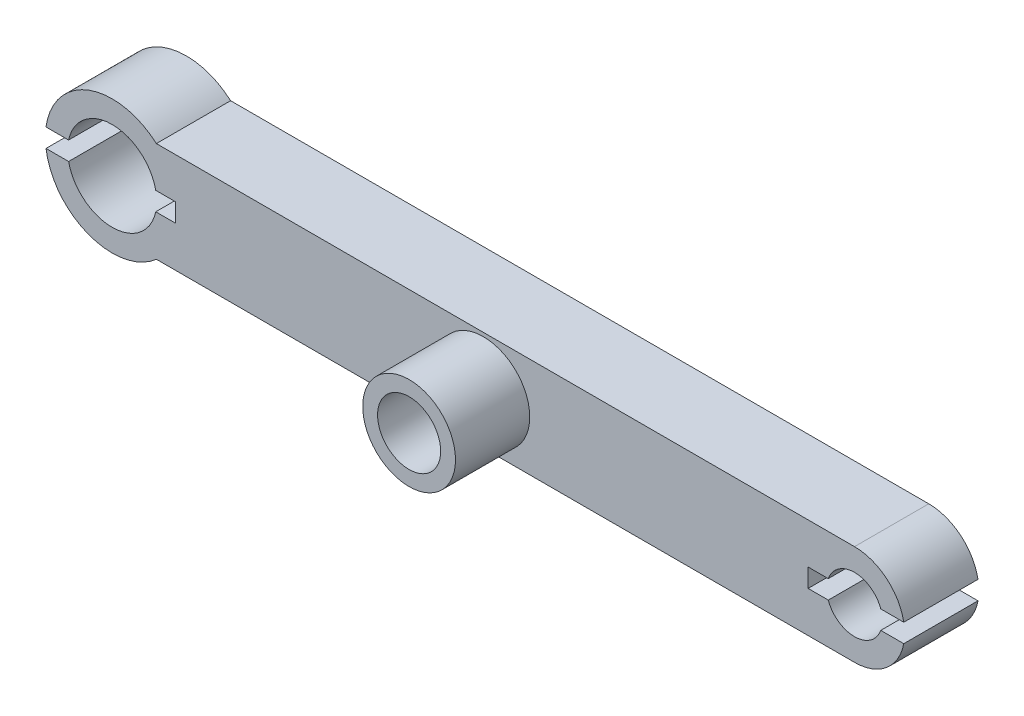
ISO-10303-21;
HEADER;
FILE_DESCRIPTION(('STEP AP214'),'2;1');
FILE_NAME('part.step','',(''),(''),'','','');
FILE_SCHEMA(('AUTOMOTIVE_DESIGN { 1 0 10303 214 1 1 1 1 }'));
ENDSEC;
DATA;
#1=APPLICATION_CONTEXT('core data for automotive mechanical design processes');
#2=APPLICATION_PROTOCOL_DEFINITION('international standard','automotive_design',2000,#1);
#3=PRODUCT_CONTEXT('',#1,'mechanical');
#4=PRODUCT('Part','Part','',(#3));
#5=PRODUCT_RELATED_PRODUCT_CATEGORY('part','',(#4));
#6=PRODUCT_DEFINITION_FORMATION('','',#4);
#7=PRODUCT_DEFINITION_CONTEXT('part definition',#1,'design');
#8=PRODUCT_DEFINITION('design','',#6,#7);
#9=PRODUCT_DEFINITION_SHAPE('','',#8);
#10=(LENGTH_UNIT() NAMED_UNIT(*) SI_UNIT(.MILLI.,.METRE.));
#11=(NAMED_UNIT(*) PLANE_ANGLE_UNIT() SI_UNIT($,.RADIAN.));
#12=(NAMED_UNIT(*) SI_UNIT($,.STERADIAN.) SOLID_ANGLE_UNIT());
#13=UNCERTAINTY_MEASURE_WITH_UNIT(LENGTH_MEASURE(1.E-05),#10,'distance_accuracy_value','');
#14=(GEOMETRIC_REPRESENTATION_CONTEXT(3) GLOBAL_UNCERTAINTY_ASSIGNED_CONTEXT((#13)) GLOBAL_UNIT_ASSIGNED_CONTEXT((#10,
#11,#12)) REPRESENTATION_CONTEXT('',''));
#15=CARTESIAN_POINT('',(0.,0.,0.));
#16=DIRECTION('',(0.,0.,1.));
#17=DIRECTION('',(1.,0.,0.));
#18=AXIS2_PLACEMENT_3D('',#15,#16,#17);
#19=CARTESIAN_POINT('',(40.,0.,4.));
#20=DIRECTION('',(0.,0.,1.));
#21=DIRECTION('',(1.,0.,0.));
#22=AXIS2_PLACEMENT_3D('',#19,#20,#21);
#23=PLANE('',#22);
#24=CARTESIAN_POINT('',(20.,0.,4.));
#25=DIRECTION('',(0.,0.,1.));
#26=DIRECTION('',(1.,0.,0.));
#27=AXIS2_PLACEMENT_3D('',#24,#25,#26);
#28=CIRCLE('',#27,2.5);
#29=CARTESIAN_POINT('',(22.5,0.,4.));
#30=VERTEX_POINT('',#29);
#31=EDGE_CURVE('E214',#30,#30,#28,.T.);
#32=ORIENTED_EDGE('',*,*,#31,.F.);
#33=EDGE_LOOP('',(#32));
#34=FACE_BOUND('',#33,.T.);
#35=CARTESIAN_POINT('',(40.,0.,4.));
#36=DIRECTION('',(0.,0.,1.));
#37=DIRECTION('',(1.,0.,0.));
#38=AXIS2_PLACEMENT_3D('',#35,#36,#37);
#39=CIRCLE('',#38,2.7);
#40=CARTESIAN_POINT('',(40.,-2.7,4.));
#41=VERTEX_POINT('',#40);
#42=CARTESIAN_POINT('',(42.6532998322843,-0.499999999999999,4.));
#43=VERTEX_POINT('',#42);
#44=EDGE_CURVE('E263',#41,#43,#39,.T.);
#45=ORIENTED_EDGE('',*,*,#44,.T.);
#46=DIRECTION('',(-1.,0.,0.));
#47=VECTOR('',#46,1.);
#48=CARTESIAN_POINT('',(40.,-0.5,4.));
#49=LINE('',#48,#47);
#50=CARTESIAN_POINT('',(41.4142135623731,-0.499999999999999,4.));
#51=VERTEX_POINT('',#50);
#52=EDGE_CURVE('E207',#43,#51,#49,.T.);
#53=ORIENTED_EDGE('',*,*,#52,.T.);
#54=CARTESIAN_POINT('',(40.,0.,4.));
#55=DIRECTION('',(0.,0.,1.));
#56=DIRECTION('',(1.,0.,0.));
#57=AXIS2_PLACEMENT_3D('',#54,#55,#56);
#58=CIRCLE('',#57,1.5);
#59=CARTESIAN_POINT('',(38.5857864376269,-0.5,4.));
#60=VERTEX_POINT('',#59);
#61=EDGE_CURVE('E256',#60,#51,#58,.T.);
#62=ORIENTED_EDGE('',*,*,#61,.F.);
#63=CARTESIAN_POINT('',(37.5,-0.5,4.));
#64=VERTEX_POINT('',#63);
#65=EDGE_CURVE('E205',#60,#64,#49,.T.);
#66=ORIENTED_EDGE('',*,*,#65,.T.);
#67=DIRECTION('',(0.,1.,0.));
#68=VECTOR('',#67,1.);
#69=CARTESIAN_POINT('',(37.5,0.,4.));
#70=LINE('',#69,#68);
#71=CARTESIAN_POINT('',(37.5,0.5,4.));
#72=VERTEX_POINT('',#71);
#73=EDGE_CURVE('E179',#64,#72,#70,.T.);
#74=ORIENTED_EDGE('',*,*,#73,.T.);
#75=DIRECTION('',(1.,0.,0.));
#76=VECTOR('',#75,1.);
#77=CARTESIAN_POINT('',(40.,0.5,4.));
#78=LINE('',#77,#76);
#79=CARTESIAN_POINT('',(38.5857864376269,0.5,4.));
#80=VERTEX_POINT('',#79);
#81=EDGE_CURVE('E203',#72,#80,#78,.T.);
#82=ORIENTED_EDGE('',*,*,#81,.T.);
#83=CARTESIAN_POINT('',(41.4142135623731,0.5,4.));
#84=VERTEX_POINT('',#83);
#85=EDGE_CURVE('E252',#84,#80,#58,.T.);
#86=ORIENTED_EDGE('',*,*,#85,.F.);
#87=CARTESIAN_POINT('',(42.6532998322843,0.5,4.));
#88=VERTEX_POINT('',#87);
#89=EDGE_CURVE('E182',#84,#88,#78,.T.);
#90=ORIENTED_EDGE('',*,*,#89,.T.);
#91=CARTESIAN_POINT('',(40.,2.70000000000001,4.));
#92=VERTEX_POINT('',#91);
#93=EDGE_CURVE('E267',#88,#92,#39,.T.);
#94=ORIENTED_EDGE('',*,*,#93,.T.);
#95=DIRECTION('',(-1.,0.,0.));
#96=VECTOR('',#95,1.);
#97=CARTESIAN_POINT('',(2.38117617995813,2.7,4.));
#98=LINE('',#97,#96);
#99=CARTESIAN_POINT('',(2.38117617995813,2.7,4.));
#100=VERTEX_POINT('',#99);
#101=EDGE_CURVE('E266',#92,#100,#98,.T.);
#102=ORIENTED_EDGE('',*,*,#101,.T.);
#103=CARTESIAN_POINT('',(0.,0.,4.));
#104=DIRECTION('',(0.,0.,1.));
#105=DIRECTION('',(1.,0.,0.));
#106=AXIS2_PLACEMENT_3D('',#103,#104,#105);
#107=CIRCLE('',#106,3.6);
#108=CARTESIAN_POINT('',(-3.56510869399518,0.5,4.));
#109=VERTEX_POINT('',#108);
#110=EDGE_CURVE('E271',#100,#109,#107,.T.);
#111=ORIENTED_EDGE('',*,*,#110,.T.);
#112=DIRECTION('',(-1.,0.,0.));
#113=VECTOR('',#112,1.);
#114=CARTESIAN_POINT('',(3.4,0.499999999999999,4.));
#115=LINE('',#114,#113);
#116=CARTESIAN_POINT('',(-2.3473389188611,0.5,4.));
#117=VERTEX_POINT('',#116);
#118=EDGE_CURVE('E226',#117,#109,#115,.T.);
#119=ORIENTED_EDGE('',*,*,#118,.F.);
#120=CARTESIAN_POINT('',(0.,0.,4.));
#121=DIRECTION('',(0.,0.,1.));
#122=DIRECTION('',(1.,0.,0.));
#123=AXIS2_PLACEMENT_3D('',#120,#121,#122);
#124=CIRCLE('',#123,2.4);
#125=CARTESIAN_POINT('',(2.3473389188611,0.499999999999999,4.));
#126=VERTEX_POINT('',#125);
#127=EDGE_CURVE('E259',#126,#117,#124,.T.);
#128=ORIENTED_EDGE('',*,*,#127,.F.);
#129=CARTESIAN_POINT('',(3.4,0.499999999999999,4.));
#130=VERTEX_POINT('',#129);
#131=EDGE_CURVE('E228',#130,#126,#115,.T.);
#132=ORIENTED_EDGE('',*,*,#131,.F.);
#133=DIRECTION('',(0.,1.,0.));
#134=VECTOR('',#133,1.);
#135=CARTESIAN_POINT('',(3.4,0.499999999999999,4.));
#136=LINE('',#135,#134);
#137=CARTESIAN_POINT('',(3.4,-0.499999999999999,4.));
#138=VERTEX_POINT('',#137);
#139=EDGE_CURVE('E224',#138,#130,#136,.T.);
#140=ORIENTED_EDGE('',*,*,#139,.F.);
#141=DIRECTION('',(1.,0.,0.));
#142=VECTOR('',#141,1.);
#143=CARTESIAN_POINT('',(3.4,-0.499999999999999,4.));
#144=LINE('',#143,#142);
#145=CARTESIAN_POINT('',(2.3473389188611,-0.499999999999999,4.));
#146=VERTEX_POINT('',#145);
#147=EDGE_CURVE('E230',#146,#138,#144,.T.);
#148=ORIENTED_EDGE('',*,*,#147,.F.);
#149=CARTESIAN_POINT('',(-2.3473389188611,-0.5,4.));
#150=VERTEX_POINT('',#149);
#151=EDGE_CURVE('E255',#150,#146,#124,.T.);
#152=ORIENTED_EDGE('',*,*,#151,.F.);
#153=CARTESIAN_POINT('',(-3.56510869399518,-0.5,4.));
#154=VERTEX_POINT('',#153);
#155=EDGE_CURVE('E232',#154,#150,#144,.T.);
#156=ORIENTED_EDGE('',*,*,#155,.F.);
#157=CARTESIAN_POINT('',(2.38117617995813,-2.7,4.));
#158=VERTEX_POINT('',#157);
#159=EDGE_CURVE('E270',#154,#158,#107,.T.);
#160=ORIENTED_EDGE('',*,*,#159,.T.);
#161=DIRECTION('',(1.,0.,0.));
#162=VECTOR('',#161,1.);
#163=CARTESIAN_POINT('',(2.38117617995813,-2.7,4.));
#164=LINE('',#163,#162);
#165=EDGE_CURVE('E274',#158,#41,#164,.T.);
#166=ORIENTED_EDGE('',*,*,#165,.T.);
#167=EDGE_LOOP('',(#45,#53,#62,#66,#74,#82,#86,#90,#94,#102,#111,#119,#128,#132,#140,#148,#152,
#156,#160,#166));
#168=FACE_BOUND('',#167,.T.);
#169=ADVANCED_FACE('F36',(#34,#168),#23,.T.);
#170=CARTESIAN_POINT('',(0.,0.,0.));
#171=DIRECTION('',(0.,0.,1.));
#172=DIRECTION('',(1.,0.,0.));
#173=AXIS2_PLACEMENT_3D('',#170,#171,#172);
#174=PLANE('',#173);
#175=CARTESIAN_POINT('',(20.,0.,0.));
#176=DIRECTION('',(0.,0.,1.));
#177=DIRECTION('',(1.,0.,0.));
#178=AXIS2_PLACEMENT_3D('',#175,#176,#177);
#179=CIRCLE('',#178,1.7);
#180=CARTESIAN_POINT('',(21.7,0.,0.));
#181=VERTEX_POINT('',#180);
#182=EDGE_CURVE('E218',#181,#181,#179,.T.);
#183=ORIENTED_EDGE('',*,*,#182,.T.);
#184=EDGE_LOOP('',(#183));
#185=FACE_BOUND('',#184,.T.);
#186=DIRECTION('',(1.,0.,0.));
#187=VECTOR('',#186,1.);
#188=CARTESIAN_POINT('',(37.5,-0.5,0.));
#189=LINE('',#188,#187);
#190=CARTESIAN_POINT('',(41.4142135623731,-0.500000000000001,0.));
#191=VERTEX_POINT('',#190);
#192=CARTESIAN_POINT('',(42.6532998322843,-0.499999999999999,0.));
#193=VERTEX_POINT('',#192);
#194=EDGE_CURVE('E51',#191,#193,#189,.T.);
#195=ORIENTED_EDGE('',*,*,#194,.T.);
#196=CARTESIAN_POINT('',(40.,0.,0.));
#197=DIRECTION('',(0.,0.,1.));
#198=DIRECTION('',(1.,0.,0.));
#199=AXIS2_PLACEMENT_3D('',#196,#197,#198);
#200=CIRCLE('',#199,2.7);
#201=CARTESIAN_POINT('',(40.,-2.7,0.));
#202=VERTEX_POINT('',#201);
#203=EDGE_CURVE('E277',#202,#193,#200,.T.);
#204=ORIENTED_EDGE('',*,*,#203,.F.);
#205=DIRECTION('',(1.,0.,0.));
#206=VECTOR('',#205,1.);
#207=CARTESIAN_POINT('',(2.38117617995813,-2.7,0.));
#208=LINE('',#207,#206);
#209=CARTESIAN_POINT('',(2.38117617995813,-2.7,0.));
#210=VERTEX_POINT('',#209);
#211=EDGE_CURVE('E283',#210,#202,#208,.T.);
#212=ORIENTED_EDGE('',*,*,#211,.F.);
#213=CARTESIAN_POINT('',(0.,0.,0.));
#214=DIRECTION('',(0.,0.,1.));
#215=DIRECTION('',(1.,0.,0.));
#216=AXIS2_PLACEMENT_3D('',#213,#214,#215);
#217=CIRCLE('',#216,3.6);
#218=CARTESIAN_POINT('',(-3.56510869399518,-0.5,0.));
#219=VERTEX_POINT('',#218);
#220=EDGE_CURVE('E294',#219,#210,#217,.T.);
#221=ORIENTED_EDGE('',*,*,#220,.F.);
#222=DIRECTION('',(1.,0.,0.));
#223=VECTOR('',#222,1.);
#224=CARTESIAN_POINT('',(3.4,-0.499999999999999,0.));
#225=LINE('',#224,#223);
#226=CARTESIAN_POINT('',(-2.3473389188611,-0.5,0.));
#227=VERTEX_POINT('',#226);
#228=EDGE_CURVE('E227',#219,#227,#225,.T.);
#229=ORIENTED_EDGE('',*,*,#228,.T.);
#230=CARTESIAN_POINT('',(0.,0.,0.));
#231=DIRECTION('',(0.,0.,1.));
#232=DIRECTION('',(1.,0.,0.));
#233=AXIS2_PLACEMENT_3D('',#230,#231,#232);
#234=CIRCLE('',#233,2.4);
#235=CARTESIAN_POINT('',(2.3473389188611,-0.499999999999999,0.));
#236=VERTEX_POINT('',#235);
#237=EDGE_CURVE('E290',#227,#236,#234,.T.);
#238=ORIENTED_EDGE('',*,*,#237,.T.);
#239=CARTESIAN_POINT('',(3.4,-0.499999999999999,0.));
#240=VERTEX_POINT('',#239);
#241=EDGE_CURVE('E239',#236,#240,#225,.T.);
#242=ORIENTED_EDGE('',*,*,#241,.T.);
#243=DIRECTION('',(0.,1.,0.));
#244=VECTOR('',#243,1.);
#245=CARTESIAN_POINT('',(3.4,0.499999999999999,0.));
#246=LINE('',#245,#244);
#247=CARTESIAN_POINT('',(3.4,0.499999999999999,0.));
#248=VERTEX_POINT('',#247);
#249=EDGE_CURVE('E223',#240,#248,#246,.T.);
#250=ORIENTED_EDGE('',*,*,#249,.T.);
#251=DIRECTION('',(-1.,0.,0.));
#252=VECTOR('',#251,1.);
#253=CARTESIAN_POINT('',(3.4,0.499999999999999,0.));
#254=LINE('',#253,#252);
#255=CARTESIAN_POINT('',(2.3473389188611,0.499999999999999,0.));
#256=VERTEX_POINT('',#255);
#257=EDGE_CURVE('E236',#248,#256,#254,.T.);
#258=ORIENTED_EDGE('',*,*,#257,.T.);
#259=CARTESIAN_POINT('',(-2.3473389188611,0.5,0.));
#260=VERTEX_POINT('',#259);
#261=EDGE_CURVE('E291',#256,#260,#234,.T.);
#262=ORIENTED_EDGE('',*,*,#261,.T.);
#263=CARTESIAN_POINT('',(-3.56510869399518,0.5,0.));
#264=VERTEX_POINT('',#263);
#265=EDGE_CURVE('E235',#260,#264,#254,.T.);
#266=ORIENTED_EDGE('',*,*,#265,.T.);
#267=CARTESIAN_POINT('',(2.38117617995813,2.7,0.));
#268=VERTEX_POINT('',#267);
#269=EDGE_CURVE('E295',#268,#264,#217,.T.);
#270=ORIENTED_EDGE('',*,*,#269,.F.);
#271=DIRECTION('',(-1.,0.,0.));
#272=VECTOR('',#271,1.);
#273=CARTESIAN_POINT('',(2.38117617995813,2.7,0.));
#274=LINE('',#273,#272);
#275=CARTESIAN_POINT('',(40.,2.70000000000001,0.));
#276=VERTEX_POINT('',#275);
#277=EDGE_CURVE('E280',#276,#268,#274,.T.);
#278=ORIENTED_EDGE('',*,*,#277,.F.);
#279=CARTESIAN_POINT('',(42.6532998322843,0.5,0.));
#280=VERTEX_POINT('',#279);
#281=EDGE_CURVE('E262',#280,#276,#200,.T.);
#282=ORIENTED_EDGE('',*,*,#281,.F.);
#283=DIRECTION('',(-1.,0.,0.));
#284=VECTOR('',#283,1.);
#285=CARTESIAN_POINT('',(37.5,0.5,0.));
#286=LINE('',#285,#284);
#287=CARTESIAN_POINT('',(41.4142135623731,0.5,0.));
#288=VERTEX_POINT('',#287);
#289=EDGE_CURVE('E198',#280,#288,#286,.T.);
#290=ORIENTED_EDGE('',*,*,#289,.T.);
#291=CARTESIAN_POINT('',(40.,0.,0.));
#292=DIRECTION('',(0.,0.,1.));
#293=DIRECTION('',(1.,0.,0.));
#294=AXIS2_PLACEMENT_3D('',#291,#292,#293);
#295=CIRCLE('',#294,1.5);
#296=CARTESIAN_POINT('',(38.5857864376269,0.500000000000001,0.));
#297=VERTEX_POINT('',#296);
#298=EDGE_CURVE('E257',#288,#297,#295,.T.);
#299=ORIENTED_EDGE('',*,*,#298,.T.);
#300=CARTESIAN_POINT('',(37.5,0.5,0.));
#301=VERTEX_POINT('',#300);
#302=EDGE_CURVE('E58',#297,#301,#286,.T.);
#303=ORIENTED_EDGE('',*,*,#302,.T.);
#304=DIRECTION('',(0.,-1.,0.));
#305=VECTOR('',#304,1.);
#306=CARTESIAN_POINT('',(37.5,-0.5,0.));
#307=LINE('',#306,#305);
#308=CARTESIAN_POINT('',(37.5,-0.5,0.));
#309=VERTEX_POINT('',#308);
#310=EDGE_CURVE('E177',#301,#309,#307,.T.);
#311=ORIENTED_EDGE('',*,*,#310,.T.);
#312=CARTESIAN_POINT('',(38.5857864376269,-0.5,0.));
#313=VERTEX_POINT('',#312);
#314=EDGE_CURVE('E186',#309,#313,#189,.T.);
#315=ORIENTED_EDGE('',*,*,#314,.T.);
#316=EDGE_CURVE('E251',#313,#191,#295,.T.);
#317=ORIENTED_EDGE('',*,*,#316,.T.);
#318=EDGE_LOOP('',(#195,#204,#212,#221,#229,#238,#242,#250,#258,#262,#266,#270,#278,#282,#290,
#299,#303,#311,#315,#317));
#319=FACE_BOUND('',#318,.T.);
#320=ADVANCED_FACE('F193',(#185,#319),#174,.F.);
#321=CARTESIAN_POINT('',(40.,0.,4.));
#322=DIRECTION('',(0.,0.,-1.));
#323=DIRECTION('',(-1.,0.,0.));
#324=AXIS2_PLACEMENT_3D('',#321,#322,#323);
#325=CYLINDRICAL_SURFACE('',#324,2.7);
#326=DIRECTION('',(0.,0.,-1.));
#327=VECTOR('',#326,1.);
#328=CARTESIAN_POINT('',(42.6532998322843,-0.499999999999999,4.));
#329=LINE('',#328,#327);
#330=EDGE_CURVE('E208',#43,#193,#329,.T.);
#331=ORIENTED_EDGE('',*,*,#330,.F.);
#332=ORIENTED_EDGE('',*,*,#44,.F.);
#333=DIRECTION('',(0.,0.,-1.));
#334=VECTOR('',#333,1.);
#335=CARTESIAN_POINT('',(40.,-2.7,4.));
#336=LINE('',#335,#334);
#337=EDGE_CURVE('E276',#41,#202,#336,.T.);
#338=ORIENTED_EDGE('',*,*,#337,.T.);
#339=ORIENTED_EDGE('',*,*,#203,.T.);
#340=EDGE_LOOP('',(#331,#332,#338,#339));
#341=FACE_BOUND('',#340,.T.);
#342=ADVANCED_FACE('F329',(#341),#325,.T.);
#343=DIRECTION('',(0.,0.,-1.));
#344=VECTOR('',#343,1.);
#345=CARTESIAN_POINT('',(42.6532998322843,0.5,4.));
#346=LINE('',#345,#344);
#347=EDGE_CURVE('E202',#280,#88,#346,.F.);
#348=ORIENTED_EDGE('',*,*,#347,.F.);
#349=ORIENTED_EDGE('',*,*,#281,.T.);
#350=DIRECTION('',(0.,0.,-1.));
#351=VECTOR('',#350,1.);
#352=CARTESIAN_POINT('',(40.,2.70000000000001,4.));
#353=LINE('',#352,#351);
#354=EDGE_CURVE('E287',#92,#276,#353,.T.);
#355=ORIENTED_EDGE('',*,*,#354,.F.);
#356=ORIENTED_EDGE('',*,*,#93,.F.);
#357=EDGE_LOOP('',(#348,#349,#355,#356));
#358=FACE_BOUND('',#357,.T.);
#359=ADVANCED_FACE('F384',(#358),#325,.T.);
#360=CARTESIAN_POINT('',(40.,0.,4.));
#361=DIRECTION('',(0.,0.,-1.));
#362=DIRECTION('',(-1.,0.,0.));
#363=AXIS2_PLACEMENT_3D('',#360,#361,#362);
#364=CYLINDRICAL_SURFACE('',#363,1.5);
#365=ORIENTED_EDGE('',*,*,#61,.T.);
#366=DIRECTION('',(0.,0.,-1.));
#367=VECTOR('',#366,1.);
#368=CARTESIAN_POINT('',(41.4142135623731,-0.499999999999999,4.));
#369=LINE('',#368,#367);
#370=EDGE_CURVE('E11',#51,#191,#369,.T.);
#371=ORIENTED_EDGE('',*,*,#370,.T.);
#372=ORIENTED_EDGE('',*,*,#316,.F.);
#373=DIRECTION('',(0.,0.,-1.));
#374=VECTOR('',#373,1.);
#375=CARTESIAN_POINT('',(38.5857864376269,-0.5,4.));
#376=LINE('',#375,#374);
#377=EDGE_CURVE('E44',#313,#60,#376,.F.);
#378=ORIENTED_EDGE('',*,*,#377,.T.);
#379=EDGE_LOOP('',(#365,#371,#372,#378));
#380=FACE_BOUND('',#379,.T.);
#381=ADVANCED_FACE('F322',(#380),#364,.F.);
#382=ORIENTED_EDGE('',*,*,#85,.T.);
#383=DIRECTION('',(0.,0.,-1.));
#384=VECTOR('',#383,1.);
#385=CARTESIAN_POINT('',(38.5857864376269,0.5,4.));
#386=LINE('',#385,#384);
#387=EDGE_CURVE('E318',#80,#297,#386,.T.);
#388=ORIENTED_EDGE('',*,*,#387,.T.);
#389=ORIENTED_EDGE('',*,*,#298,.F.);
#390=DIRECTION('',(0.,0.,-1.));
#391=VECTOR('',#390,1.);
#392=CARTESIAN_POINT('',(41.4142135623731,0.5,4.));
#393=LINE('',#392,#391);
#394=EDGE_CURVE('E315',#288,#84,#393,.F.);
#395=ORIENTED_EDGE('',*,*,#394,.T.);
#396=EDGE_LOOP('',(#382,#388,#389,#395));
#397=FACE_BOUND('',#396,.T.);
#398=ADVANCED_FACE('F390',(#397),#364,.F.);
#399=CARTESIAN_POINT('',(0.,0.,3.9));
#400=DIRECTION('',(0.,0.,-1.));
#401=DIRECTION('',(-1.,0.,0.));
#402=AXIS2_PLACEMENT_3D('',#399,#400,#401);
#403=CYLINDRICAL_SURFACE('',#402,3.6);
#404=DIRECTION('',(0.,0.,-1.));
#405=VECTOR('',#404,1.);
#406=CARTESIAN_POINT('',(-3.56510869399518,0.5,3.9));
#407=LINE('',#406,#405);
#408=EDGE_CURVE('E249',#109,#264,#407,.T.);
#409=ORIENTED_EDGE('',*,*,#408,.F.);
#410=ORIENTED_EDGE('',*,*,#110,.F.);
#411=DIRECTION('',(0.,0.,-1.));
#412=VECTOR('',#411,1.);
#413=CARTESIAN_POINT('',(2.38117617995813,2.7,3.9));
#414=LINE('',#413,#412);
#415=EDGE_CURVE('E301',#268,#100,#414,.F.);
#416=ORIENTED_EDGE('',*,*,#415,.F.);
#417=ORIENTED_EDGE('',*,*,#269,.T.);
#418=EDGE_LOOP('',(#409,#410,#416,#417));
#419=FACE_BOUND('',#418,.T.);
#420=ADVANCED_FACE('F38',(#419),#403,.T.);
#421=DIRECTION('',(0.,0.,-1.));
#422=VECTOR('',#421,1.);
#423=CARTESIAN_POINT('',(-3.56510869399518,-0.5,3.9));
#424=LINE('',#423,#422);
#425=EDGE_CURVE('E247',#219,#154,#424,.F.);
#426=ORIENTED_EDGE('',*,*,#425,.F.);
#427=ORIENTED_EDGE('',*,*,#220,.T.);
#428=DIRECTION('',(0.,0.,-1.));
#429=VECTOR('',#428,1.);
#430=CARTESIAN_POINT('',(2.38117617995813,-2.7,3.9));
#431=LINE('',#430,#429);
#432=EDGE_CURVE('E298',#158,#210,#431,.T.);
#433=ORIENTED_EDGE('',*,*,#432,.F.);
#434=ORIENTED_EDGE('',*,*,#159,.F.);
#435=EDGE_LOOP('',(#426,#427,#433,#434));
#436=FACE_BOUND('',#435,.T.);
#437=ADVANCED_FACE('F342',(#436),#403,.T.);
#438=CARTESIAN_POINT('',(0.,0.,3.9));
#439=DIRECTION('',(0.,0.,-1.));
#440=DIRECTION('',(-1.,0.,0.));
#441=AXIS2_PLACEMENT_3D('',#438,#439,#440);
#442=CYLINDRICAL_SURFACE('',#441,2.4);
#443=ORIENTED_EDGE('',*,*,#127,.T.);
#444=DIRECTION('',(0.,0.,-1.));
#445=VECTOR('',#444,1.);
#446=CARTESIAN_POINT('',(-2.3473389188611,0.5,3.9));
#447=LINE('',#446,#445);
#448=EDGE_CURVE('E312',#117,#260,#447,.T.);
#449=ORIENTED_EDGE('',*,*,#448,.T.);
#450=ORIENTED_EDGE('',*,*,#261,.F.);
#451=DIRECTION('',(0.,0.,-1.));
#452=VECTOR('',#451,1.);
#453=CARTESIAN_POINT('',(2.3473389188611,0.499999999999999,3.9));
#454=LINE('',#453,#452);
#455=EDGE_CURVE('E309',#256,#126,#454,.F.);
#456=ORIENTED_EDGE('',*,*,#455,.T.);
#457=EDGE_LOOP('',(#443,#449,#450,#456));
#458=FACE_BOUND('',#457,.T.);
#459=ADVANCED_FACE('F367',(#458),#442,.F.);
#460=ORIENTED_EDGE('',*,*,#151,.T.);
#461=DIRECTION('',(0.,0.,-1.));
#462=VECTOR('',#461,1.);
#463=CARTESIAN_POINT('',(2.3473389188611,-0.499999999999999,3.9));
#464=LINE('',#463,#462);
#465=EDGE_CURVE('E306',#146,#236,#464,.T.);
#466=ORIENTED_EDGE('',*,*,#465,.T.);
#467=ORIENTED_EDGE('',*,*,#237,.F.);
#468=DIRECTION('',(0.,0.,-1.));
#469=VECTOR('',#468,1.);
#470=CARTESIAN_POINT('',(-2.3473389188611,-0.5,3.9));
#471=LINE('',#470,#469);
#472=EDGE_CURVE('E303',#227,#150,#471,.F.);
#473=ORIENTED_EDGE('',*,*,#472,.T.);
#474=EDGE_LOOP('',(#460,#466,#467,#473));
#475=FACE_BOUND('',#474,.T.);
#476=ADVANCED_FACE('F351',(#475),#442,.F.);
#477=CARTESIAN_POINT('',(2.38117617995813,2.7,4.));
#478=DIRECTION('',(0.,-1.,0.));
#479=DIRECTION('',(1.,0.,0.));
#480=AXIS2_PLACEMENT_3D('',#477,#478,#479);
#481=PLANE('',#480);
#482=ORIENTED_EDGE('',*,*,#277,.T.);
#483=ORIENTED_EDGE('',*,*,#415,.T.);
#484=ORIENTED_EDGE('',*,*,#101,.F.);
#485=ORIENTED_EDGE('',*,*,#354,.T.);
#486=EDGE_LOOP('',(#482,#483,#484,#485));
#487=FACE_BOUND('',#486,.T.);
#488=ADVANCED_FACE('F378',(#487),#481,.F.);
#489=CARTESIAN_POINT('',(2.38117617995813,-2.7,4.));
#490=DIRECTION('',(0.,1.,0.));
#491=DIRECTION('',(0.,0.,1.));
#492=AXIS2_PLACEMENT_3D('',#489,#490,#491);
#493=PLANE('',#492);
#494=ORIENTED_EDGE('',*,*,#211,.T.);
#495=ORIENTED_EDGE('',*,*,#337,.F.);
#496=ORIENTED_EDGE('',*,*,#165,.F.);
#497=ORIENTED_EDGE('',*,*,#432,.T.);
#498=EDGE_LOOP('',(#494,#495,#496,#497));
#499=FACE_BOUND('',#498,.T.);
#500=ADVANCED_FACE('F336',(#499),#493,.F.);
#501=CARTESIAN_POINT('',(3.4,-0.499999999999999,4.));
#502=DIRECTION('',(0.,1.,0.));
#503=DIRECTION('',(-1.,0.,0.));
#504=AXIS2_PLACEMENT_3D('',#501,#502,#503);
#505=PLANE('',#504);
#506=ORIENTED_EDGE('',*,*,#425,.T.);
#507=ORIENTED_EDGE('',*,*,#155,.T.);
#508=ORIENTED_EDGE('',*,*,#472,.F.);
#509=ORIENTED_EDGE('',*,*,#228,.F.);
#510=EDGE_LOOP('',(#506,#507,#508,#509));
#511=FACE_BOUND('',#510,.T.);
#512=ADVANCED_FACE('F345',(#511),#505,.T.);
#513=ORIENTED_EDGE('',*,*,#147,.T.);
#514=DIRECTION('',(0.,0.,-1.));
#515=VECTOR('',#514,1.);
#516=CARTESIAN_POINT('',(3.4,-0.499999999999999,4.));
#517=LINE('',#516,#515);
#518=EDGE_CURVE('E242',#138,#240,#517,.T.);
#519=ORIENTED_EDGE('',*,*,#518,.T.);
#520=ORIENTED_EDGE('',*,*,#241,.F.);
#521=ORIENTED_EDGE('',*,*,#465,.F.);
#522=EDGE_LOOP('',(#513,#519,#520,#521));
#523=FACE_BOUND('',#522,.T.);
#524=ADVANCED_FACE('F356',(#523),#505,.T.);
#525=CARTESIAN_POINT('',(3.4,0.499999999999999,4.));
#526=DIRECTION('',(0.,-1.,0.));
#527=DIRECTION('',(1.,0.,0.));
#528=AXIS2_PLACEMENT_3D('',#525,#526,#527);
#529=PLANE('',#528);
#530=ORIENTED_EDGE('',*,*,#257,.F.);
#531=DIRECTION('',(0.,0.,-1.));
#532=VECTOR('',#531,1.);
#533=CARTESIAN_POINT('',(3.4,0.499999999999999,4.));
#534=LINE('',#533,#532);
#535=EDGE_CURVE('E244',#130,#248,#534,.T.);
#536=ORIENTED_EDGE('',*,*,#535,.F.);
#537=ORIENTED_EDGE('',*,*,#131,.T.);
#538=ORIENTED_EDGE('',*,*,#455,.F.);
#539=EDGE_LOOP('',(#530,#536,#537,#538));
#540=FACE_BOUND('',#539,.T.);
#541=ADVANCED_FACE('F363',(#540),#529,.T.);
#542=CARTESIAN_POINT('',(3.4,0.499999999999999,4.));
#543=DIRECTION('',(-1.,0.,0.));
#544=DIRECTION('',(0.,0.,1.));
#545=AXIS2_PLACEMENT_3D('',#542,#543,#544);
#546=PLANE('',#545);
#547=ORIENTED_EDGE('',*,*,#249,.F.);
#548=ORIENTED_EDGE('',*,*,#518,.F.);
#549=ORIENTED_EDGE('',*,*,#139,.T.);
#550=ORIENTED_EDGE('',*,*,#535,.T.);
#551=EDGE_LOOP('',(#547,#548,#549,#550));
#552=FACE_BOUND('',#551,.T.);
#553=ADVANCED_FACE('F359',(#552),#546,.T.);
#554=ORIENTED_EDGE('',*,*,#408,.T.);
#555=ORIENTED_EDGE('',*,*,#265,.F.);
#556=ORIENTED_EDGE('',*,*,#448,.F.);
#557=ORIENTED_EDGE('',*,*,#118,.T.);
#558=EDGE_LOOP('',(#554,#555,#556,#557));
#559=FACE_BOUND('',#558,.T.);
#560=ADVANCED_FACE('F482',(#559),#529,.T.);
#561=CARTESIAN_POINT('',(20.,0.,4.));
#562=DIRECTION('',(0.,0.,-1.));
#563=DIRECTION('',(-1.,0.,0.));
#564=AXIS2_PLACEMENT_3D('',#561,#562,#563);
#565=CYLINDRICAL_SURFACE('',#564,1.7);
#566=ORIENTED_EDGE('',*,*,#182,.F.);
#567=EDGE_LOOP('',(#566));
#568=FACE_BOUND('',#567,.T.);
#569=CARTESIAN_POINT('',(20.,0.,8.));
#570=DIRECTION('',(0.,0.,1.));
#571=DIRECTION('',(1.,0.,0.));
#572=AXIS2_PLACEMENT_3D('',#569,#570,#571);
#573=CIRCLE('',#572,1.7);
#574=CARTESIAN_POINT('',(21.7,0.,8.));
#575=VERTEX_POINT('',#574);
#576=EDGE_CURVE('E211',#575,#575,#573,.T.);
#577=ORIENTED_EDGE('',*,*,#576,.T.);
#578=EDGE_LOOP('',(#577));
#579=FACE_BOUND('',#578,.T.);
#580=ADVANCED_FACE('F472',(#568,#579),#565,.F.);
#581=CARTESIAN_POINT('',(20.,0.,8.));
#582=DIRECTION('',(0.,0.,1.));
#583=DIRECTION('',(1.,0.,0.));
#584=AXIS2_PLACEMENT_3D('',#581,#582,#583);
#585=PLANE('',#584);
#586=CARTESIAN_POINT('',(20.,0.,8.));
#587=DIRECTION('',(0.,0.,1.));
#588=DIRECTION('',(1.,0.,0.));
#589=AXIS2_PLACEMENT_3D('',#586,#587,#588);
#590=CIRCLE('',#589,2.5);
#591=CARTESIAN_POINT('',(22.5,0.,8.));
#592=VERTEX_POINT('',#591);
#593=EDGE_CURVE('E215',#592,#592,#590,.T.);
#594=ORIENTED_EDGE('',*,*,#593,.T.);
#595=EDGE_LOOP('',(#594));
#596=FACE_BOUND('',#595,.T.);
#597=ORIENTED_EDGE('',*,*,#576,.F.);
#598=EDGE_LOOP('',(#597));
#599=FACE_BOUND('',#598,.T.);
#600=ADVANCED_FACE('F461',(#596,#599),#585,.T.);
#601=CARTESIAN_POINT('',(20.,0.,8.));
#602=DIRECTION('',(0.,0.,-1.));
#603=DIRECTION('',(-1.,0.,0.));
#604=AXIS2_PLACEMENT_3D('',#601,#602,#603);
#605=CYLINDRICAL_SURFACE('',#604,2.5);
#606=ORIENTED_EDGE('',*,*,#593,.F.);
#607=EDGE_LOOP('',(#606));
#608=FACE_BOUND('',#607,.T.);
#609=ORIENTED_EDGE('',*,*,#31,.T.);
#610=EDGE_LOOP('',(#609));
#611=FACE_BOUND('',#610,.T.);
#612=ADVANCED_FACE('F401',(#608,#611),#605,.T.);
#613=CARTESIAN_POINT('',(37.5,0.5,8.));
#614=DIRECTION('',(0.,-1.,0.));
#615=DIRECTION('',(0.,0.,-1.));
#616=AXIS2_PLACEMENT_3D('',#613,#614,#615);
#617=PLANE('',#616);
#618=ORIENTED_EDGE('',*,*,#347,.T.);
#619=ORIENTED_EDGE('',*,*,#89,.F.);
#620=ORIENTED_EDGE('',*,*,#394,.F.);
#621=ORIENTED_EDGE('',*,*,#289,.F.);
#622=EDGE_LOOP('',(#618,#619,#620,#621));
#623=FACE_BOUND('',#622,.T.);
#624=ADVANCED_FACE('F394',(#623),#617,.T.);
#625=DIRECTION('',(0.,0.,-1.));
#626=VECTOR('',#625,1.);
#627=CARTESIAN_POINT('',(37.5,0.5,8.));
#628=LINE('',#627,#626);
#629=EDGE_CURVE('E183',#72,#301,#628,.T.);
#630=ORIENTED_EDGE('',*,*,#629,.T.);
#631=ORIENTED_EDGE('',*,*,#302,.F.);
#632=ORIENTED_EDGE('',*,*,#387,.F.);
#633=ORIENTED_EDGE('',*,*,#81,.F.);
#634=EDGE_LOOP('',(#630,#631,#632,#633));
#635=FACE_BOUND('',#634,.T.);
#636=ADVANCED_FACE('F392',(#635),#617,.T.);
#637=CARTESIAN_POINT('',(37.5,-0.5,8.));
#638=DIRECTION('',(0.,1.,0.));
#639=DIRECTION('',(-1.,0.,0.));
#640=AXIS2_PLACEMENT_3D('',#637,#638,#639);
#641=PLANE('',#640);
#642=ORIENTED_EDGE('',*,*,#377,.F.);
#643=ORIENTED_EDGE('',*,*,#314,.F.);
#644=DIRECTION('',(0.,0.,-1.));
#645=VECTOR('',#644,1.);
#646=CARTESIAN_POINT('',(37.5,-0.5,8.));
#647=LINE('',#646,#645);
#648=EDGE_CURVE('E172',#64,#309,#647,.T.);
#649=ORIENTED_EDGE('',*,*,#648,.F.);
#650=ORIENTED_EDGE('',*,*,#65,.F.);
#651=EDGE_LOOP('',(#642,#643,#649,#650));
#652=FACE_BOUND('',#651,.T.);
#653=ADVANCED_FACE('F187',(#652),#641,.T.);
#654=CARTESIAN_POINT('',(37.5,-0.5,8.));
#655=DIRECTION('',(1.,0.,0.));
#656=DIRECTION('',(0.,0.,-1.));
#657=AXIS2_PLACEMENT_3D('',#654,#655,#656);
#658=PLANE('',#657);
#659=ORIENTED_EDGE('',*,*,#648,.T.);
#660=ORIENTED_EDGE('',*,*,#310,.F.);
#661=ORIENTED_EDGE('',*,*,#629,.F.);
#662=ORIENTED_EDGE('',*,*,#73,.F.);
#663=EDGE_LOOP('',(#659,#660,#661,#662));
#664=FACE_BOUND('',#663,.T.);
#665=ADVANCED_FACE('F174',(#664),#658,.T.);
#666=ORIENTED_EDGE('',*,*,#330,.T.);
#667=ORIENTED_EDGE('',*,*,#194,.F.);
#668=ORIENTED_EDGE('',*,*,#370,.F.);
#669=ORIENTED_EDGE('',*,*,#52,.F.);
#670=EDGE_LOOP('',(#666,#667,#668,#669));
#671=FACE_BOUND('',#670,.T.);
#672=ADVANCED_FACE('F327',(#671),#641,.T.);
#673=CLOSED_SHELL('',(#169,#320,#342,#359,#381,#398,#420,#437,#459,#476,#488,#500,#512,#524,
#541,#553,#560,#580,#600,#612,#624,#636,#653,#665,#672));
#674=MANIFOLD_SOLID_BREP('B2',#673);
#675=ADVANCED_BREP_SHAPE_REPRESENTATION('',(#18,#674),#14);
#676=SHAPE_DEFINITION_REPRESENTATION(#9,#675);
ENDSEC;
END-ISO-10303-21;
